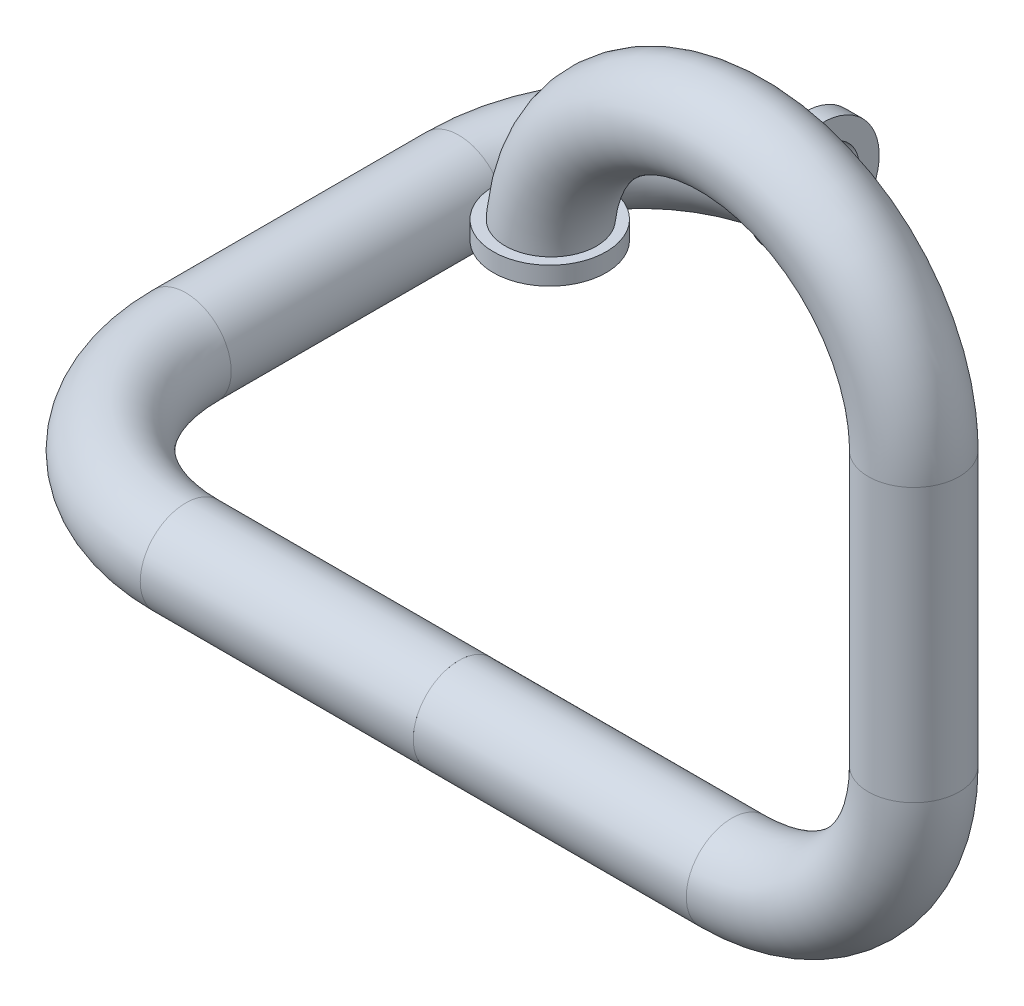
ISO-10303-21;
HEADER;
FILE_DESCRIPTION(('STEP AP214'),'2;1');
FILE_NAME('part.step','',(''),(''),'','','');
FILE_SCHEMA(('AUTOMOTIVE_DESIGN { 1 0 10303 214 1 1 1 1 }'));
ENDSEC;
DATA;
#1=APPLICATION_CONTEXT('core data for automotive mechanical design processes');
#2=APPLICATION_PROTOCOL_DEFINITION('international standard','automotive_design',2000,#1);
#3=PRODUCT_CONTEXT('',#1,'mechanical');
#4=PRODUCT('Part','Part','',(#3));
#5=PRODUCT_RELATED_PRODUCT_CATEGORY('part','',(#4));
#6=PRODUCT_DEFINITION_FORMATION('','',#4);
#7=PRODUCT_DEFINITION_CONTEXT('part definition',#1,'design');
#8=PRODUCT_DEFINITION('design','',#6,#7);
#9=PRODUCT_DEFINITION_SHAPE('','',#8);
#10=(LENGTH_UNIT() NAMED_UNIT(*) SI_UNIT(.MILLI.,.METRE.));
#11=(NAMED_UNIT(*) PLANE_ANGLE_UNIT() SI_UNIT($,.RADIAN.));
#12=(NAMED_UNIT(*) SI_UNIT($,.STERADIAN.) SOLID_ANGLE_UNIT());
#13=UNCERTAINTY_MEASURE_WITH_UNIT(LENGTH_MEASURE(1.E-05),#10,'distance_accuracy_value','');
#14=(GEOMETRIC_REPRESENTATION_CONTEXT(3) GLOBAL_UNCERTAINTY_ASSIGNED_CONTEXT((#13)) GLOBAL_UNIT_ASSIGNED_CONTEXT((#10,
#11,#12)) REPRESENTATION_CONTEXT('',''));
#15=CARTESIAN_POINT('',(0.,0.,0.));
#16=DIRECTION('',(0.,0.,1.));
#17=DIRECTION('',(1.,0.,0.));
#18=AXIS2_PLACEMENT_3D('',#15,#16,#17);
#19=CARTESIAN_POINT('',(-1.,-2.49999999999997,-2.5));
#20=DIRECTION('',(0.,-1.,0.));
#21=DIRECTION('',(-1.,0.,0.));
#22=AXIS2_PLACEMENT_3D('',#19,#20,#21);
#23=TOROIDAL_SURFACE('',#22,1.,0.25);
#24=CARTESIAN_POINT('',(-2.,-2.49999999999997,-2.5));
#25=DIRECTION('',(0.,0.,1.));
#26=DIRECTION('',(1.,0.,0.));
#27=AXIS2_PLACEMENT_3D('',#24,#25,#26);
#28=CIRCLE('',#27,0.25);
#29=CARTESIAN_POINT('',(-1.75,-2.49999999999997,-2.5));
#30=VERTEX_POINT('',#29);
#31=EDGE_CURVE('E69',#30,#30,#28,.T.);
#32=ORIENTED_EDGE('',*,*,#31,.F.);
#33=EDGE_LOOP('',(#32));
#34=FACE_BOUND('',#33,.T.);
#35=CARTESIAN_POINT('',(-1.1,-2.65623963793902,-3.29859890368239));
#36=CARTESIAN_POINT('',(-1.1,-2.66725207760954,-3.30748461825524));
#37=CARTESIAN_POINT('',(-1.1,-2.67751891621626,-3.31731154482602));
#38=CARTESIAN_POINT('',(-1.1,-2.69626373386053,-3.33855979360369));
#39=CARTESIAN_POINT('',(-1.1,-2.70473937428027,-3.34998316824432));
#40=CARTESIAN_POINT('',(-1.1,-2.71965059164286,-3.37408196910666));
#41=CARTESIAN_POINT('',(-1.1,-2.72608758280257,-3.386756519343));
#42=CARTESIAN_POINT('',(-1.1,-2.73674792220665,-3.41300023448786));
#43=CARTESIAN_POINT('',(-1.1,-2.74097185095739,-3.42656916374023));
#44=CARTESIAN_POINT('',(-1.1,-2.74710037643283,-3.45426609808908));
#45=CARTESIAN_POINT('',(-1.1,-2.74899764423923,-3.46839572582249));
#46=CARTESIAN_POINT('',(-1.1,-2.7503929044324,-3.49677370794496));
#47=CARTESIAN_POINT('',(-1.1,-2.74989078403278,-3.51102206788375));
#48=CARTESIAN_POINT('',(-1.1,-2.74649821555128,-3.53922913334701));
#49=CARTESIAN_POINT('',(-1.1,-2.7436082057798,-3.5531878915475));
#50=CARTESIAN_POINT('',(-1.1,-2.73551838704396,-3.58041932555233));
#51=CARTESIAN_POINT('',(-1.1,-2.73031861462664,-3.59369201220857));
#52=CARTESIAN_POINT('',(-1.1,-2.71777309713946,-3.61913001861259));
#53=CARTESIAN_POINT('',(-1.1,-2.71043405726885,-3.63129864492456));
#54=CARTESIAN_POINT('',(-1.1,-2.69380938875734,-3.65422440361082));
#55=CARTESIAN_POINT('',(-1.1,-2.68452380420333,-3.66498156794405));
#56=CARTESIAN_POINT('',(-1.1,-2.66430995715404,-3.68473296660521));
#57=CARTESIAN_POINT('',(-1.1,-2.65338847528619,-3.69373414042714));
#58=CARTESIAN_POINT('',(-1.1,-2.63018485864796,-3.7097674288013));
#59=CARTESIAN_POINT('',(-1.1,-2.61790274918155,-3.7167995799634));
#60=CARTESIAN_POINT('',(-1.1,-2.59237323038552,-3.72866989147601));
#61=CARTESIAN_POINT('',(-1.1,-2.57912937079562,-3.73351568693935));
#62=CARTESIAN_POINT('',(-1.1,-2.55201508745365,-3.74090948117469));
#63=CARTESIAN_POINT('',(-1.1,-2.53814467275927,-3.74345751315272));
#64=CARTESIAN_POINT('',(-1.1,-2.5102038849674,-3.74617903253143));
#65=CARTESIAN_POINT('',(-1.1,-2.49613402183291,-3.74635775803878));
#66=CARTESIAN_POINT('',(-1.1,-2.46816429077879,-3.7443490557881));
#67=CARTESIAN_POINT('',(-1.1,-2.4542644218515,-3.74216164206245));
#68=CARTESIAN_POINT('',(-1.1,-2.42703714682501,-3.73548566564956));
#69=CARTESIAN_POINT('',(-1.1,-2.41370942348579,-3.73099839651049));
#70=CARTESIAN_POINT('',(-1.1,-2.38799527759161,-3.71985250641525));
#71=CARTESIAN_POINT('',(-1.1,-2.37560885748421,-3.7131938798134));
#72=CARTESIAN_POINT('',(-1.1,-2.35211278170529,-3.69788731542389));
#73=CARTESIAN_POINT('',(-1.1,-2.34100461687592,-3.68923708938564));
#74=CARTESIAN_POINT('',(-1.1,-2.3203933598736,-3.67019911655825));
#75=CARTESIAN_POINT('',(-1.1,-2.3108902858315,-3.65981135014478));
#76=CARTESIAN_POINT('',(-1.1,-2.29373053982587,-3.63756371948689));
#77=CARTESIAN_POINT('',(-1.1,-2.28607894695728,-3.6256999380033));
#78=CARTESIAN_POINT('',(-1.1,-2.2728674582373,-3.60086000651179));
#79=CARTESIAN_POINT('',(-1.1,-2.26730760120466,-3.58788383586549));
#80=CARTESIAN_POINT('',(-1.1,-2.25841456798207,-3.56113487356717));
#81=CARTESIAN_POINT('',(-1.1,-2.25508993780622,-3.54735924079537));
#82=CARTESIAN_POINT('',(-1.1,-2.25079070072853,-3.51944604647422));
#83=CARTESIAN_POINT('',(-1.1,-2.24981614861393,-3.50530847649481));
#84=CARTESIAN_POINT('',(-1.1,-2.25024182801909,-3.4770136765723));
#85=CARTESIAN_POINT('',(-1.1,-2.25165137413854,-3.46285658644129));
#86=CARTESIAN_POINT('',(-1.1,-2.25682122574272,-3.43497822630541));
#87=CARTESIAN_POINT('',(-1.1,-2.2605815751941,-3.42125696445682));
#88=CARTESIAN_POINT('',(-1.1,-2.27035874608223,-3.39460613735038));
#89=CARTESIAN_POINT('',(-1.1,-2.27638090606419,-3.38167853001149));
#90=CARTESIAN_POINT('',(-1.1,-2.29051249490454,-3.35701911324203));
#91=CARTESIAN_POINT('',(-1.1,-2.29862193372864,-3.3452873095212));
#92=CARTESIAN_POINT('',(-1.1,-2.31669082732941,-3.32337073898221));
#93=CARTESIAN_POINT('',(-1.1,-2.32664803560638,-3.31318412058785));
#94=CARTESIAN_POINT('',(-1.1,-2.34814005090378,-3.29463870405255));
#95=CARTESIAN_POINT('',(-1.1,-2.35967481605871,-3.28627985742117));
#96=CARTESIAN_POINT('',(-1.1,-2.38392513538251,-3.27168127958962));
#97=CARTESIAN_POINT('',(-1.1,-2.39663352689323,-3.26542965254311));
#98=CARTESIAN_POINT('',(-1.1,-2.42292480081764,-3.25516854334937));
#99=CARTESIAN_POINT('',(-1.1,-2.43650760332564,-3.25115885665188));
#100=CARTESIAN_POINT('',(-1.1,-2.46404545577347,-3.24552688282323));
#101=CARTESIAN_POINT('',(-1.1,-2.47799663724179,-3.24388566967865));
#102=CARTESIAN_POINT('',(-1.1,-2.50597955267885,-3.24298034692899));
#103=CARTESIAN_POINT('',(-1.1,-2.52001130360179,-3.24371675742366));
#104=CARTESIAN_POINT('',(-1.1,-2.54769244267739,-3.24753647692591));
#105=CARTESIAN_POINT('',(-1.1,-2.56134313820702,-3.25061036534622));
#106=CARTESIAN_POINT('',(-1.1,-2.58792473279217,-3.2589995811081));
#107=CARTESIAN_POINT('',(-1.1,-2.60085647623826,-3.26431221334144));
#108=CARTESIAN_POINT('',(-1.1,-2.62086769552547,-3.27456413039254));
#109=CARTESIAN_POINT('',(-1.1,-2.62828402648601,-3.2788601779382));
#110=CARTESIAN_POINT('',(-1.1,-2.64263780387059,-3.28818888620585));
#111=CARTESIAN_POINT('',(-1.1,-2.6495752514394,-3.29322154516689));
#112=CARTESIAN_POINT('',(-1.1,-2.65623963793902,-3.29859890368239));
#113=B_SPLINE_CURVE_WITH_KNOTS('',3,(#35,#36,#37,#38,#39,#40,#41,#42,#43,#44,#45,#46,#47,#48,
#49,#50,#51,#52,#53,#54,#55,#56,#57,#58,#59,#60,#61,#62,#63,#64,#65,#66,#67,#68,#69,#70,#71,#72,
#73,#74,#75,#76,#77,#78,#79,#80,#81,#82,#83,#84,#85,#86,#87,#88,#89,#90,#91,#92,#93,#94,#95,#96,
#97,#98,#99,#100,#101,#102,#103,#104,#105,#106,#107,#108,#109,#110,#111,#112),.UNSPECIFIED.,.T.,
.F.,(4,2,2,2,2,2,2,2,2,2,2,2,2,2,2,2,2,2,2,2,2,2,2,2,2,2,2,2,2,2,2,2,2,2,2,2,2,2,4),(0.,
0.0424192772184807,0.084893600183786,0.127338393721264,0.169772048022751,0.21233902665477,
0.254908006223219,0.297469173753553,0.340029667868765,0.382458171419216,0.424885714119334,
0.467142031024321,0.509397562208716,0.551504365817852,0.593610560912518,0.635623651286504,
0.677636492503144,0.719625729586843,0.76161507584624,0.803652908716628,0.845691216407669,
0.88784357092604,0.929996707675384,0.97231010702195,1.01462449280908,1.05710458176961,
1.09958546525149,1.14216725288102,1.18474924382094,1.22727979920904,1.26980922613231,
1.3120943759003,1.35437566702383,1.39631718923709,1.43826788668425,1.48005040315259,
1.52178276285504,1.54745365347394,1.57312448272488),.UNSPECIFIED.);
#114=CARTESIAN_POINT('',(-1.1,-2.65623963793902,-3.29859890368239));
#115=VERTEX_POINT('',#114);
#116=EDGE_CURVE('E12',#115,#115,#113,.T.);
#117=ORIENTED_EDGE('',*,*,#116,.F.);
#118=EDGE_LOOP('',(#117));
#119=FACE_BOUND('',#118,.T.);
#120=ADVANCED_FACE('F39',(#34,#119),#23,.T.);
#121=CARTESIAN_POINT('',(0.5,-2.49999999999997,-2.5));
#122=DIRECTION('',(1.,0.,0.));
#123=DIRECTION('',(0.,-1.,0.));
#124=AXIS2_PLACEMENT_3D('',#121,#122,#123);
#125=PLANE('',#124);
#126=CARTESIAN_POINT('',(0.5,-2.5,0.));
#127=DIRECTION('',(1.,0.,0.));
#128=DIRECTION('',(0.,-1.,0.));
#129=AXIS2_PLACEMENT_3D('',#126,#127,#128);
#130=CIRCLE('',#129,0.2);
#131=CARTESIAN_POINT('',(0.5,-2.7,0.));
#132=VERTEX_POINT('',#131);
#133=EDGE_CURVE('E59',#132,#132,#130,.F.);
#134=ORIENTED_EDGE('',*,*,#133,.T.);
#135=EDGE_LOOP('',(#134));
#136=FACE_BOUND('',#135,.T.);
#137=CARTESIAN_POINT('',(0.5,-2.5,0.));
#138=DIRECTION('',(1.,0.,0.));
#139=DIRECTION('',(0.,-1.,0.));
#140=AXIS2_PLACEMENT_3D('',#137,#138,#139);
#141=CIRCLE('',#140,0.25);
#142=CARTESIAN_POINT('',(0.5,-2.75,0.));
#143=VERTEX_POINT('',#142);
#144=EDGE_CURVE('E54',#143,#143,#141,.F.);
#145=ORIENTED_EDGE('',*,*,#144,.F.);
#146=EDGE_LOOP('',(#145));
#147=FACE_BOUND('',#146,.T.);
#148=ADVANCED_FACE('F116',(#136,#147),#125,.T.);
#149=CARTESIAN_POINT('',(-1.,-2.5,0.));
#150=DIRECTION('',(1.,0.,0.));
#151=DIRECTION('',(0.,0.,-1.));
#152=AXIS2_PLACEMENT_3D('',#149,#150,#151);
#153=CYLINDRICAL_SURFACE('',#152,0.25);
#154=CARTESIAN_POINT('',(-1.,-2.5,0.));
#155=DIRECTION('',(1.,0.,0.));
#156=DIRECTION('',(0.,0.,-1.));
#157=AXIS2_PLACEMENT_3D('',#154,#155,#156);
#158=CIRCLE('',#157,0.25);
#159=CARTESIAN_POINT('',(-1.,-2.5,0.25));
#160=VERTEX_POINT('',#159);
#161=EDGE_CURVE('E78',#160,#160,#158,.T.);
#162=ORIENTED_EDGE('',*,*,#161,.T.);
#163=EDGE_LOOP('',(#162));
#164=FACE_BOUND('',#163,.T.);
#165=ORIENTED_EDGE('',*,*,#144,.T.);
#166=EDGE_LOOP('',(#165));
#167=FACE_BOUND('',#166,.T.);
#168=ADVANCED_FACE('F121',(#164,#167),#153,.T.);
#169=CARTESIAN_POINT('',(-1.,-2.5,0.));
#170=DIRECTION('',(1.,0.,0.));
#171=DIRECTION('',(0.,0.,-1.));
#172=AXIS2_PLACEMENT_3D('',#169,#170,#171);
#173=CYLINDRICAL_SURFACE('',#172,0.2);
#174=CARTESIAN_POINT('',(-1.,-2.5,0.));
#175=DIRECTION('',(1.,0.,0.));
#176=DIRECTION('',(0.,1.,0.));
#177=AXIS2_PLACEMENT_3D('',#174,#175,#176);
#178=CIRCLE('',#177,0.2);
#179=CARTESIAN_POINT('',(-1.,-2.5,0.2));
#180=VERTEX_POINT('',#179);
#181=EDGE_CURVE('E50',#180,#180,#178,.T.);
#182=ORIENTED_EDGE('',*,*,#181,.F.);
#183=EDGE_LOOP('',(#182));
#184=FACE_BOUND('',#183,.T.);
#185=ORIENTED_EDGE('',*,*,#133,.F.);
#186=EDGE_LOOP('',(#185));
#187=FACE_BOUND('',#186,.T.);
#188=ADVANCED_FACE('F41',(#184,#187),#173,.F.);
#189=CARTESIAN_POINT('',(-1.,-2.49999999999997,-2.5));
#190=DIRECTION('',(1.,0.,0.));
#191=DIRECTION('',(0.,-1.,0.));
#192=AXIS2_PLACEMENT_3D('',#189,#190,#191);
#193=PLANE('',#192);
#194=CARTESIAN_POINT('',(-1.,-2.49999999999996,-3.5));
#195=DIRECTION('',(1.,0.,0.));
#196=DIRECTION('',(0.,-1.,0.));
#197=AXIS2_PLACEMENT_3D('',#194,#195,#196);
#198=CIRCLE('',#197,0.31);
#199=CARTESIAN_POINT('',(-1.,-2.80999999999996,-3.5));
#200=VERTEX_POINT('',#199);
#201=EDGE_CURVE('E86',#200,#200,#198,.T.);
#202=ORIENTED_EDGE('',*,*,#201,.T.);
#203=EDGE_LOOP('',(#202));
#204=FACE_BOUND('',#203,.T.);
#205=CARTESIAN_POINT('',(-1.,-2.49999999999996,-3.5));
#206=DIRECTION('',(1.,0.,0.));
#207=DIRECTION('',(0.,-1.,0.));
#208=AXIS2_PLACEMENT_3D('',#205,#206,#207);
#209=CIRCLE('',#208,0.2);
#210=CARTESIAN_POINT('',(-1.,-2.49999999999996,-3.7));
#211=VERTEX_POINT('',#210);
#212=EDGE_CURVE('E62',#211,#211,#209,.T.);
#213=ORIENTED_EDGE('',*,*,#212,.F.);
#214=EDGE_LOOP('',(#213));
#215=FACE_BOUND('',#214,.T.);
#216=ADVANCED_FACE('F110',(#204,#215),#193,.T.);
#217=CARTESIAN_POINT('',(-2.,-2.49999999999997,-2.5));
#218=DIRECTION('',(0.,0.,1.));
#219=DIRECTION('',(1.,0.,0.));
#220=AXIS2_PLACEMENT_3D('',#217,#218,#219);
#221=CYLINDRICAL_SURFACE('',#220,0.25);
#222=ORIENTED_EDGE('',*,*,#31,.T.);
#223=EDGE_LOOP('',(#222));
#224=FACE_BOUND('',#223,.T.);
#225=CARTESIAN_POINT('',(-2.,-2.49999999999999,-1.));
#226=DIRECTION('',(0.,0.,-1.));
#227=DIRECTION('',(-1.,0.,0.));
#228=AXIS2_PLACEMENT_3D('',#225,#226,#227);
#229=CIRCLE('',#228,0.25);
#230=CARTESIAN_POINT('',(-2.25,-2.49999999999999,-1.));
#231=VERTEX_POINT('',#230);
#232=EDGE_CURVE('E65',#231,#231,#229,.F.);
#233=ORIENTED_EDGE('',*,*,#232,.F.);
#234=EDGE_LOOP('',(#233));
#235=FACE_BOUND('',#234,.T.);
#236=ADVANCED_FACE('F123',(#224,#235),#221,.T.);
#237=CARTESIAN_POINT('',(-1.,-2.49999999999999,-1.));
#238=DIRECTION('',(0.,1.,0.));
#239=DIRECTION('',(1.,0.,0.));
#240=AXIS2_PLACEMENT_3D('',#237,#238,#239);
#241=TOROIDAL_SURFACE('',#240,1.,0.25);
#242=CARTESIAN_POINT('',(-1.,-2.49999999999999,-1.));
#243=DIRECTION('',(0.,1.,0.));
#244=DIRECTION('',(1.,0.,0.));
#245=AXIS2_PLACEMENT_3D('',#242,#243,#244);
#246=CIRCLE('',#245,1.25);
#247=EDGE_CURVE('',#231,#160,#246,.T.);
#248=ORIENTED_EDGE('',*,*,#232,.T.);
#249=ORIENTED_EDGE('',*,*,#161,.F.);
#250=ORIENTED_EDGE('',*,*,#247,.T.);
#251=ORIENTED_EDGE('',*,*,#247,.F.);
#252=EDGE_LOOP('',(#248,#250,#249,#251));
#253=FACE_BOUND('',#252,.T.);
#254=ADVANCED_FACE('F111',(#253),#241,.T.);
#255=CARTESIAN_POINT('',(-2.,-2.49999999999997,-2.5));
#256=DIRECTION('',(0.,0.,1.));
#257=DIRECTION('',(1.,0.,0.));
#258=AXIS2_PLACEMENT_3D('',#255,#256,#257);
#259=CYLINDRICAL_SURFACE('',#258,0.2);
#260=CARTESIAN_POINT('',(-2.,-2.49999999999997,-2.5));
#261=DIRECTION('',(0.,0.,1.));
#262=DIRECTION('',(0.,1.,0.));
#263=AXIS2_PLACEMENT_3D('',#260,#261,#262);
#264=CIRCLE('',#263,0.2);
#265=CARTESIAN_POINT('',(-2.2,-2.49999999999997,-2.5));
#266=VERTEX_POINT('',#265);
#267=EDGE_CURVE('E84',#266,#266,#264,.T.);
#268=ORIENTED_EDGE('',*,*,#267,.F.);
#269=EDGE_LOOP('',(#268));
#270=FACE_BOUND('',#269,.T.);
#271=CARTESIAN_POINT('',(-2.,-2.49999999999999,-1.));
#272=DIRECTION('',(0.,0.,1.));
#273=DIRECTION('',(0.,1.,0.));
#274=AXIS2_PLACEMENT_3D('',#271,#272,#273);
#275=CIRCLE('',#274,0.2);
#276=CARTESIAN_POINT('',(-2.2,-2.49999999999999,-1.));
#277=VERTEX_POINT('',#276);
#278=EDGE_CURVE('E74',#277,#277,#275,.T.);
#279=ORIENTED_EDGE('',*,*,#278,.T.);
#280=EDGE_LOOP('',(#279));
#281=FACE_BOUND('',#280,.T.);
#282=ADVANCED_FACE('F98',(#270,#281),#259,.F.);
#283=CARTESIAN_POINT('',(-1.,-2.49999999999999,-1.));
#284=DIRECTION('',(0.,1.,0.));
#285=DIRECTION('',(1.,0.,0.));
#286=AXIS2_PLACEMENT_3D('',#283,#284,#285);
#287=TOROIDAL_SURFACE('',#286,1.,0.2);
#288=CARTESIAN_POINT('',(-1.,-2.49999999999999,-1.));
#289=DIRECTION('',(0.,1.,0.));
#290=DIRECTION('',(1.,0.,0.));
#291=AXIS2_PLACEMENT_3D('',#288,#289,#290);
#292=CIRCLE('',#291,1.2);
#293=EDGE_CURVE('',#277,#180,#292,.T.);
#294=ORIENTED_EDGE('',*,*,#278,.F.);
#295=ORIENTED_EDGE('',*,*,#181,.T.);
#296=ORIENTED_EDGE('',*,*,#293,.T.);
#297=ORIENTED_EDGE('',*,*,#293,.F.);
#298=EDGE_LOOP('',(#294,#296,#295,#297));
#299=FACE_BOUND('',#298,.T.);
#300=ADVANCED_FACE('F100',(#299),#287,.F.);
#301=CARTESIAN_POINT('',(-1.,-2.49999999999997,-2.5));
#302=DIRECTION('',(0.,-1.,0.));
#303=DIRECTION('',(-1.,0.,0.));
#304=AXIS2_PLACEMENT_3D('',#301,#302,#303);
#305=TOROIDAL_SURFACE('',#304,1.,0.2);
#306=CARTESIAN_POINT('',(-1.,-2.49999999999997,-2.5));
#307=DIRECTION('',(0.,-1.,0.));
#308=DIRECTION('',(-1.,0.,0.));
#309=AXIS2_PLACEMENT_3D('',#306,#307,#308);
#310=CIRCLE('',#309,1.2);
#311=EDGE_CURVE('',#266,#211,#310,.T.);
#312=ORIENTED_EDGE('',*,*,#267,.T.);
#313=ORIENTED_EDGE('',*,*,#212,.T.);
#314=ORIENTED_EDGE('',*,*,#311,.T.);
#315=ORIENTED_EDGE('',*,*,#311,.F.);
#316=EDGE_LOOP('',(#312,#314,#313,#315));
#317=FACE_BOUND('',#316,.T.);
#318=ADVANCED_FACE('F102',(#317),#305,.F.);
#319=CARTESIAN_POINT('',(-1.1,-2.49999999999996,-3.5));
#320=DIRECTION('',(1.,0.,0.));
#321=DIRECTION('',(0.,-1.,0.));
#322=AXIS2_PLACEMENT_3D('',#319,#320,#321);
#323=PLANE('',#322);
#324=CARTESIAN_POINT('',(-1.1,-2.49999999999996,-3.5));
#325=DIRECTION('',(1.,0.,0.));
#326=DIRECTION('',(0.,-1.,0.));
#327=AXIS2_PLACEMENT_3D('',#324,#325,#326);
#328=CIRCLE('',#327,0.31);
#329=CARTESIAN_POINT('',(-1.1,-2.80999999999996,-3.5));
#330=VERTEX_POINT('',#329);
#331=EDGE_CURVE('E80',#330,#330,#328,.T.);
#332=ORIENTED_EDGE('',*,*,#331,.F.);
#333=EDGE_LOOP('',(#332));
#334=FACE_BOUND('',#333,.T.);
#335=ORIENTED_EDGE('',*,*,#116,.T.);
#336=EDGE_LOOP('',(#335));
#337=FACE_BOUND('',#336,.T.);
#338=ADVANCED_FACE('F108',(#334,#337),#323,.F.);
#339=CARTESIAN_POINT('',(-1.1,-2.49999999999996,-3.5));
#340=DIRECTION('',(1.,0.,0.));
#341=DIRECTION('',(0.,-1.,0.));
#342=AXIS2_PLACEMENT_3D('',#339,#340,#341);
#343=CYLINDRICAL_SURFACE('',#342,0.31);
#344=ORIENTED_EDGE('',*,*,#331,.T.);
#345=EDGE_LOOP('',(#344));
#346=FACE_BOUND('',#345,.T.);
#347=ORIENTED_EDGE('',*,*,#201,.F.);
#348=EDGE_LOOP('',(#347));
#349=FACE_BOUND('',#348,.T.);
#350=ADVANCED_FACE('F208',(#346,#349),#343,.T.);
#351=CLOSED_SHELL('',(#120,#148,#168,#188,#216,#236,#254,#282,#300,#318,#338,#350));
#352=MANIFOLD_SOLID_BREP('B2',#351);
#353=CARTESIAN_POINT('',(0.5,0.,0.));
#354=DIRECTION('',(1.,0.,0.));
#355=DIRECTION('',(0.,0.,-1.));
#356=AXIS2_PLACEMENT_3D('',#353,#354,#355);
#357=PLANE('',#356);
#358=CARTESIAN_POINT('',(0.5,-2.5,0.));
#359=DIRECTION('',(1.,0.,0.));
#360=DIRECTION('',(0.,0.,-1.));
#361=AXIS2_PLACEMENT_3D('',#358,#359,#360);
#362=CIRCLE('',#361,0.25);
#363=CARTESIAN_POINT('',(0.5,-2.5,-0.25));
#364=VERTEX_POINT('',#363);
#365=EDGE_CURVE('E38',#364,#364,#362,.F.);
#366=ORIENTED_EDGE('',*,*,#365,.T.);
#367=EDGE_LOOP('',(#366));
#368=FACE_BOUND('',#367,.T.);
#369=CARTESIAN_POINT('',(0.5,-2.5,0.));
#370=DIRECTION('',(1.,0.,0.));
#371=DIRECTION('',(0.,0.,-1.));
#372=AXIS2_PLACEMENT_3D('',#369,#370,#371);
#373=CIRCLE('',#372,0.2);
#374=CARTESIAN_POINT('',(0.5,-2.5,-0.2));
#375=VERTEX_POINT('',#374);
#376=EDGE_CURVE('E239',#375,#375,#373,.F.);
#377=ORIENTED_EDGE('',*,*,#376,.F.);
#378=EDGE_LOOP('',(#377));
#379=FACE_BOUND('',#378,.T.);
#380=ADVANCED_FACE('F233',(#368,#379),#357,.F.);
#381=CARTESIAN_POINT('',(-1.,-2.5,0.));
#382=DIRECTION('',(1.,0.,0.));
#383=DIRECTION('',(0.,1.,0.));
#384=AXIS2_PLACEMENT_3D('',#381,#382,#383);
#385=CYLINDRICAL_SURFACE('',#384,0.25);
#386=ORIENTED_EDGE('',*,*,#365,.F.);
#387=EDGE_LOOP('',(#386));
#388=FACE_BOUND('',#387,.T.);
#389=CARTESIAN_POINT('',(2.,-2.5,0.));
#390=DIRECTION('',(1.,0.,0.));
#391=DIRECTION('',(0.,1.,0.));
#392=AXIS2_PLACEMENT_3D('',#389,#390,#391);
#393=CIRCLE('',#392,0.25);
#394=CARTESIAN_POINT('',(2.,-2.75,0.));
#395=VERTEX_POINT('',#394);
#396=EDGE_CURVE('E243',#395,#395,#393,.T.);
#397=ORIENTED_EDGE('',*,*,#396,.F.);
#398=EDGE_LOOP('',(#397));
#399=FACE_BOUND('',#398,.T.);
#400=ADVANCED_FACE('F276',(#388,#399),#385,.T.);
#401=CARTESIAN_POINT('',(1.,0.,0.));
#402=DIRECTION('',(0.,1.,0.));
#403=DIRECTION('',(0.,0.,1.));
#404=AXIS2_PLACEMENT_3D('',#401,#402,#403);
#405=PLANE('',#404);
#406=CARTESIAN_POINT('',(1.,0.,0.));
#407=DIRECTION('',(0.,-1.,0.));
#408=DIRECTION('',(0.,0.,1.));
#409=AXIS2_PLACEMENT_3D('',#406,#407,#408);
#410=CIRCLE('',#409,0.2);
#411=CARTESIAN_POINT('',(0.800000000000001,0.,0.));
#412=VERTEX_POINT('',#411);
#413=EDGE_CURVE('E257',#412,#412,#410,.T.);
#414=ORIENTED_EDGE('',*,*,#413,.F.);
#415=EDGE_LOOP('',(#414));
#416=FACE_BOUND('',#415,.T.);
#417=CARTESIAN_POINT('',(1.,0.,0.));
#418=DIRECTION('',(0.,-1.,0.));
#419=DIRECTION('',(0.,0.,1.));
#420=AXIS2_PLACEMENT_3D('',#417,#418,#419);
#421=CIRCLE('',#420,0.31);
#422=CARTESIAN_POINT('',(1.,0.,0.31));
#423=VERTEX_POINT('',#422);
#424=EDGE_CURVE('E320',#423,#423,#421,.T.);
#425=ORIENTED_EDGE('',*,*,#424,.T.);
#426=EDGE_LOOP('',(#425));
#427=FACE_BOUND('',#426,.T.);
#428=ADVANCED_FACE('F278',(#416,#427),#405,.F.);
#429=CARTESIAN_POINT('',(2.,0.,0.));
#430=DIRECTION('',(0.,0.,-1.));
#431=DIRECTION('',(1.,0.,0.));
#432=AXIS2_PLACEMENT_3D('',#429,#430,#431);
#433=TOROIDAL_SURFACE('',#432,1.,0.2);
#434=CARTESIAN_POINT('',(3.,0.,0.));
#435=DIRECTION('',(0.,1.,0.));
#436=DIRECTION('',(0.,0.,1.));
#437=AXIS2_PLACEMENT_3D('',#434,#435,#436);
#438=CIRCLE('',#437,0.2);
#439=CARTESIAN_POINT('',(3.2,0.,0.));
#440=VERTEX_POINT('',#439);
#441=EDGE_CURVE('E327',#440,#440,#438,.T.);
#442=CARTESIAN_POINT('',(2.,0.,0.));
#443=DIRECTION('',(0.,0.,-1.));
#444=DIRECTION('',(1.,0.,0.));
#445=AXIS2_PLACEMENT_3D('',#442,#443,#444);
#446=CIRCLE('',#445,1.2);
#447=EDGE_CURVE('',#412,#440,#446,.T.);
#448=ORIENTED_EDGE('',*,*,#413,.T.);
#449=ORIENTED_EDGE('',*,*,#441,.F.);
#450=ORIENTED_EDGE('',*,*,#447,.T.);
#451=ORIENTED_EDGE('',*,*,#447,.F.);
#452=EDGE_LOOP('',(#448,#450,#449,#451));
#453=FACE_BOUND('',#452,.T.);
#454=ADVANCED_FACE('F285',(#453),#433,.F.);
#455=CARTESIAN_POINT('',(3.,0.,0.));
#456=DIRECTION('',(0.,-1.,0.));
#457=DIRECTION('',(-1.,0.,0.));
#458=AXIS2_PLACEMENT_3D('',#455,#456,#457);
#459=CYLINDRICAL_SURFACE('',#458,0.2);
#460=ORIENTED_EDGE('',*,*,#441,.T.);
#461=EDGE_LOOP('',(#460));
#462=FACE_BOUND('',#461,.T.);
#463=CARTESIAN_POINT('',(3.,-1.5,0.));
#464=DIRECTION('',(0.,1.,0.));
#465=DIRECTION('',(0.,0.,1.));
#466=AXIS2_PLACEMENT_3D('',#463,#464,#465);
#467=CIRCLE('',#466,0.2);
#468=CARTESIAN_POINT('',(3.2,-1.5,0.));
#469=VERTEX_POINT('',#468);
#470=EDGE_CURVE('E330',#469,#469,#467,.T.);
#471=ORIENTED_EDGE('',*,*,#470,.F.);
#472=EDGE_LOOP('',(#471));
#473=FACE_BOUND('',#472,.T.);
#474=ADVANCED_FACE('F301',(#462,#473),#459,.F.);
#475=CARTESIAN_POINT('',(2.,-1.5,0.));
#476=DIRECTION('',(0.,0.,1.));
#477=DIRECTION('',(-1.,0.,0.));
#478=AXIS2_PLACEMENT_3D('',#475,#476,#477);
#479=TOROIDAL_SURFACE('',#478,1.,0.2);
#480=CARTESIAN_POINT('',(2.,-2.5,0.));
#481=DIRECTION('',(1.,0.,0.));
#482=DIRECTION('',(0.,0.,1.));
#483=AXIS2_PLACEMENT_3D('',#480,#481,#482);
#484=CIRCLE('',#483,0.2);
#485=CARTESIAN_POINT('',(2.,-2.7,0.));
#486=VERTEX_POINT('',#485);
#487=EDGE_CURVE('E333',#486,#486,#484,.T.);
#488=CARTESIAN_POINT('',(2.,-1.5,0.));
#489=DIRECTION('',(0.,0.,1.));
#490=DIRECTION('',(-1.,0.,0.));
#491=AXIS2_PLACEMENT_3D('',#488,#489,#490);
#492=CIRCLE('',#491,1.2);
#493=EDGE_CURVE('',#486,#469,#492,.T.);
#494=ORIENTED_EDGE('',*,*,#487,.F.);
#495=ORIENTED_EDGE('',*,*,#470,.T.);
#496=ORIENTED_EDGE('',*,*,#493,.T.);
#497=ORIENTED_EDGE('',*,*,#493,.F.);
#498=EDGE_LOOP('',(#494,#496,#495,#497));
#499=FACE_BOUND('',#498,.T.);
#500=ADVANCED_FACE('F275',(#499),#479,.F.);
#501=CARTESIAN_POINT('',(-1.,-2.5,0.));
#502=DIRECTION('',(1.,0.,0.));
#503=DIRECTION('',(0.,1.,0.));
#504=AXIS2_PLACEMENT_3D('',#501,#502,#503);
#505=CYLINDRICAL_SURFACE('',#504,0.2);
#506=ORIENTED_EDGE('',*,*,#376,.T.);
#507=EDGE_LOOP('',(#506));
#508=FACE_BOUND('',#507,.T.);
#509=ORIENTED_EDGE('',*,*,#487,.T.);
#510=EDGE_LOOP('',(#509));
#511=FACE_BOUND('',#510,.T.);
#512=ADVANCED_FACE('F272',(#508,#511),#505,.F.);
#513=CARTESIAN_POINT('',(1.,0.0999999999999996,0.));
#514=DIRECTION('',(0.,-1.,0.));
#515=DIRECTION('',(0.,0.,-1.));
#516=AXIS2_PLACEMENT_3D('',#513,#514,#515);
#517=CYLINDRICAL_SURFACE('',#516,0.31);
#518=CARTESIAN_POINT('',(1.,0.0999999999999996,0.));
#519=DIRECTION('',(0.,-1.,0.));
#520=DIRECTION('',(0.,0.,1.));
#521=AXIS2_PLACEMENT_3D('',#518,#519,#520);
#522=CIRCLE('',#521,0.31);
#523=CARTESIAN_POINT('',(1.,0.0999999999999996,0.31));
#524=VERTEX_POINT('',#523);
#525=EDGE_CURVE('E258',#524,#524,#522,.T.);
#526=ORIENTED_EDGE('',*,*,#525,.T.);
#527=EDGE_LOOP('',(#526));
#528=FACE_BOUND('',#527,.T.);
#529=ORIENTED_EDGE('',*,*,#424,.F.);
#530=EDGE_LOOP('',(#529));
#531=FACE_BOUND('',#530,.T.);
#532=ADVANCED_FACE('F274',(#528,#531),#517,.T.);
#533=CARTESIAN_POINT('',(1.,0.0999999999999996,0.));
#534=DIRECTION('',(0.,1.,0.));
#535=DIRECTION('',(0.,0.,1.));
#536=AXIS2_PLACEMENT_3D('',#533,#534,#535);
#537=PLANE('',#536);
#538=ORIENTED_EDGE('',*,*,#525,.F.);
#539=EDGE_LOOP('',(#538));
#540=FACE_BOUND('',#539,.T.);
#541=CARTESIAN_POINT('',(1.20140109631761,0.0999999999999994,-0.156239637939055));
#542=CARTESIAN_POINT('',(1.21019061571474,0.0999999999999994,-0.145344468335609));
#543=CARTESIAN_POINT('',(1.21807172210946,0.0999999999999994,-0.133703962300581));
#544=CARTESIAN_POINT('',(1.23177790310757,0.0999999999999994,-0.109257379143088));
#545=CARTESIAN_POINT('',(1.237600690406,0.0999999999999994,-0.096450025107835));
#546=CARTESIAN_POINT('',(1.24700765016561,0.0999999999999994,-0.0700386597896411));
#547=CARTESIAN_POINT('',(1.25059219436236,0.0999999999999994,-0.0564347812071185));
#548=CARTESIAN_POINT('',(1.25541318839992,0.0999999999999994,-0.0288206461573356));
#549=CARTESIAN_POINT('',(1.25665023046536,0.0999999999999994,-0.014810493090211));
#550=CARTESIAN_POINT('',(1.25674012956133,0.0999999999999994,0.0131538110387401));
#551=CARTESIAN_POINT('',(1.25560376128764,0.0999999999999994,0.0271079282969863));
#552=CARTESIAN_POINT('',(1.25100317267413,0.0999999999999994,0.0546272137432173));
#553=CARTESIAN_POINT('',(1.24753888231816,0.0999999999999994,0.0681923702197628));
#554=CARTESIAN_POINT('',(1.23838863374503,0.0999999999999994,0.0945453892648773));
#555=CARTESIAN_POINT('',(1.23270348712941,0.0999999999999994,0.107333533818285));
#556=CARTESIAN_POINT('',(1.21927977306228,0.0999999999999994,0.131782096781474));
#557=CARTESIAN_POINT('',(1.21154114762927,0.0999999999999994,0.143442483335476));
#558=CARTESIAN_POINT('',(1.19418083260693,0.0999999999999995,0.16538311643698));
#559=CARTESIAN_POINT('',(1.18454778916345,0.0999999999999995,0.175654378083549));
#560=CARTESIAN_POINT('',(1.16370586490868,0.0999999999999995,0.194449314988614));
#561=CARTESIAN_POINT('',(1.15249692087162,0.0999999999999995,0.202972920096664));
#562=CARTESIAN_POINT('',(1.12872743217782,0.0999999999999995,0.218098495866874));
#563=CARTESIAN_POINT('',(1.11615711045901,0.0999999999999995,0.224685104803622));
#564=CARTESIAN_POINT('',(1.09009255829582,0.0999999999999995,0.235665425768117));
#565=CARTESIAN_POINT('',(1.07659830142009,0.0999999999999995,0.240059075031189));
#566=CARTESIAN_POINT('',(1.0490037254833,0.0999999999999996,0.246545191192852));
#567=CARTESIAN_POINT('',(1.03490096979586,0.0999999999999996,0.248627297728038));
#568=CARTESIAN_POINT('',(1.00654593496887,0.0999999999999996,0.250394447161815));
#569=CARTESIAN_POINT('',(0.992293655189753,0.0999999999999996,0.250079479803207));
#570=CARTESIAN_POINT('',(0.964044783835867,0.0999999999999996,0.247058139402245));
#571=CARTESIAN_POINT('',(0.95004818958155,0.0999999999999996,0.244351791435899));
#572=CARTESIAN_POINT('',(0.922710586450209,0.0999999999999997,0.236620477359455));
#573=CARTESIAN_POINT('',(0.909369569109577,0.0999999999999997,0.23159554119143));
#574=CARTESIAN_POINT('',(0.883765586512359,0.0999999999999997,0.219384869006445));
#575=CARTESIAN_POINT('',(0.871499478830634,0.0999999999999997,0.212205722852414));
#576=CARTESIAN_POINT('',(0.848353160880975,0.0999999999999997,0.195882113872184));
#577=CARTESIAN_POINT('',(0.837472922002869,0.0999999999999997,0.186737691628039));
#578=CARTESIAN_POINT('',(0.817453819567474,0.0999999999999997,0.166782766405174));
#579=CARTESIAN_POINT('',(0.808308112284606,0.0999999999999997,0.155979129073377));
#580=CARTESIAN_POINT('',(0.791968057395513,0.0999999999999998,0.132985122648441));
#581=CARTESIAN_POINT('',(0.784773671079474,0.0999999999999998,0.120794781071202));
#582=CARTESIAN_POINT('',(0.772566712871766,0.0999999999999998,0.095420262938804));
#583=CARTESIAN_POINT('',(0.767546469379715,0.0999999999999998,0.0822397766594054));
#584=CARTESIAN_POINT('',(0.759795746832072,0.0999999999999998,0.0552219448415193));
#585=CARTESIAN_POINT('',(0.757065234762672,0.0999999999999998,0.0413846087766634));
#586=CARTESIAN_POINT('',(0.753976519279488,0.0999999999999998,0.013479573995303));
#587=CARTESIAN_POINT('',(0.753612942574423,0.0999999999999998,-0.000587530219673126));
#588=CARTESIAN_POINT('',(0.755254272349145,0.0999999999999998,-0.0285828177191339));
#589=CARTESIAN_POINT('',(0.757259164603744,0.0999999999999998,-0.0425110018374756));
#590=CARTESIAN_POINT('',(0.763577570254616,0.0999999999999998,-0.069824146498636));
#591=CARTESIAN_POINT('',(0.76788963229582,0.0999999999999998,-0.0832094428634802));
#592=CARTESIAN_POINT('',(0.778697386164953,0.0999999999999998,-0.109067212165587));
#593=CARTESIAN_POINT('',(0.785193080784411,0.0999999999999998,-0.121539683935882));
#594=CARTESIAN_POINT('',(0.800190008892191,0.0999999999999997,-0.145233133026621));
#595=CARTESIAN_POINT('',(0.808693418744189,0.0999999999999997,-0.156452732655624));
#596=CARTESIAN_POINT('',(0.827458597227383,0.0999999999999997,-0.177309784421281));
#597=CARTESIAN_POINT('',(0.837720388123736,0.0999999999999997,-0.18694721652102));
#598=CARTESIAN_POINT('',(0.859739463821489,0.0999999999999997,-0.20439458897411));
#599=CARTESIAN_POINT('',(0.871500649143087,0.0999999999999997,-0.212199606378334));
#600=CARTESIAN_POINT('',(0.896162545480009,0.0999999999999997,-0.225732886882564));
#601=CARTESIAN_POINT('',(0.909063279872268,0.0999999999999997,-0.231461107366438));
#602=CARTESIAN_POINT('',(0.935690177297002,0.0999999999999997,-0.240701650163389));
#603=CARTESIAN_POINT('',(0.949419285126398,0.0999999999999996,-0.244205486570355));
#604=CARTESIAN_POINT('',(0.977269513121592,0.0999999999999996,-0.248868281721869));
#605=CARTESIAN_POINT('',(0.991390626994743,0.0999999999999996,-0.250027278084741));
#606=CARTESIAN_POINT('',(1.01968231033146,0.0999999999999996,-0.249971637934856));
#607=CARTESIAN_POINT('',(1.03385286183813,0.0999999999999996,-0.248747884057992));
#608=CARTESIAN_POINT('',(1.06179290963795,0.0999999999999995,-0.243944388235435));
#609=CARTESIAN_POINT('',(1.07556229838005,0.0999999999999995,-0.240364020446176));
#610=CARTESIAN_POINT('',(1.10234573174545,0.0999999999999995,-0.230935097081438));
#611=CARTESIAN_POINT('',(1.1153574306868,0.0999999999999995,-0.225079887987269));
#612=CARTESIAN_POINT('',(1.14020018687569,0.0999999999999995,-0.211269182973001));
#613=CARTESIAN_POINT('',(1.15203262501892,0.0999999999999995,-0.203316184310893));
#614=CARTESIAN_POINT('',(1.17015055889538,0.0999999999999995,-0.188776882063845));
#615=CARTESIAN_POINT('',(1.17688861698793,0.0999999999999995,-0.182745072414765));
#616=CARTESIAN_POINT('',(1.18967760471602,0.0999999999999995,-0.169992202553551));
#617=CARTESIAN_POINT('',(1.19572853335573,0.0999999999999994,-0.163271141342544));
#618=CARTESIAN_POINT('',(1.20140109631761,0.0999999999999994,-0.156239637939055));
#619=B_SPLINE_CURVE_WITH_KNOTS('',3,(#541,#542,#543,#544,#545,#546,#547,#548,#549,#550,#551,
#552,#553,#554,#555,#556,#557,#558,#559,#560,#561,#562,#563,#564,#565,#566,#567,#568,#569,#570,
#571,#572,#573,#574,#575,#576,#577,#578,#579,#580,#581,#582,#583,#584,#585,#586,#587,#588,#589,
#590,#591,#592,#593,#594,#595,#596,#597,#598,#599,#600,#601,#602,#603,#604,#605,#606,#607,#608,
#609,#610,#611,#612,#613,#614,#615,#616,#617,#618),.UNSPECIFIED.,.T.,.F.,(4,2,2,2,2,2,2,2,2,2,2,
2,2,2,2,2,2,2,2,2,2,2,2,2,2,2,2,2,2,2,2,2,2,2,2,2,2,2,4),(0.,0.0419631052503928,
0.0839726964411998,0.125975308668973,0.167967323125762,0.209769118662524,0.251572171514233,
0.293359961905662,0.335148932332196,0.377196440897467,0.419245636907758,0.461619835954524,
0.503995247723258,0.54655982933734,0.589124593087474,0.631688910508933,0.6742526782734,
0.716687545691694,0.759121536933536,0.801384450217337,0.843646525038764,0.88575823574167,
0.927869339259047,0.969884810944665,1.01190003028372,1.05388885042508,1.09587772424463,
1.13791232469054,1.17994745743075,1.22209426111071,1.26424192959939,1.30654943795309,
1.34885626756105,1.39132529833847,1.43380561212635,1.47641112039157,1.51896613717817,
1.5460481653165,1.57313023270311),.UNSPECIFIED.);
#620=CARTESIAN_POINT('',(1.20140109631761,0.0999999999999994,-0.156239637939055));
#621=VERTEX_POINT('',#620);
#622=EDGE_CURVE('E250',#621,#621,#619,.T.);
#623=ORIENTED_EDGE('',*,*,#622,.T.);
#624=EDGE_LOOP('',(#623));
#625=FACE_BOUND('',#624,.T.);
#626=ADVANCED_FACE('F261',(#540,#625),#537,.T.);
#627=CARTESIAN_POINT('',(2.,0.,0.));
#628=DIRECTION('',(0.,0.,-1.));
#629=DIRECTION('',(1.,0.,0.));
#630=AXIS2_PLACEMENT_3D('',#627,#628,#629);
#631=TOROIDAL_SURFACE('',#630,1.,0.25);
#632=ORIENTED_EDGE('',*,*,#622,.F.);
#633=EDGE_LOOP('',(#632));
#634=FACE_BOUND('',#633,.T.);
#635=CARTESIAN_POINT('',(3.,0.,0.));
#636=DIRECTION('',(0.,1.,0.));
#637=DIRECTION('',(-1.,0.,0.));
#638=AXIS2_PLACEMENT_3D('',#635,#636,#637);
#639=CIRCLE('',#638,0.25);
#640=CARTESIAN_POINT('',(2.75,0.,0.));
#641=VERTEX_POINT('',#640);
#642=EDGE_CURVE('E259',#641,#641,#639,.T.);
#643=ORIENTED_EDGE('',*,*,#642,.T.);
#644=EDGE_LOOP('',(#643));
#645=FACE_BOUND('',#644,.T.);
#646=ADVANCED_FACE('F264',(#634,#645),#631,.T.);
#647=CARTESIAN_POINT('',(3.,0.,0.));
#648=DIRECTION('',(0.,-1.,0.));
#649=DIRECTION('',(-1.,0.,0.));
#650=AXIS2_PLACEMENT_3D('',#647,#648,#649);
#651=CYLINDRICAL_SURFACE('',#650,0.25);
#652=ORIENTED_EDGE('',*,*,#642,.F.);
#653=EDGE_LOOP('',(#652));
#654=FACE_BOUND('',#653,.T.);
#655=CARTESIAN_POINT('',(3.,-1.5,0.));
#656=DIRECTION('',(0.,-1.,0.));
#657=DIRECTION('',(1.,0.,0.));
#658=AXIS2_PLACEMENT_3D('',#655,#656,#657);
#659=CIRCLE('',#658,0.25);
#660=CARTESIAN_POINT('',(3.25,-1.5,0.));
#661=VERTEX_POINT('',#660);
#662=EDGE_CURVE('E247',#661,#661,#659,.F.);
#663=ORIENTED_EDGE('',*,*,#662,.T.);
#664=EDGE_LOOP('',(#663));
#665=FACE_BOUND('',#664,.T.);
#666=ADVANCED_FACE('F269',(#654,#665),#651,.T.);
#667=CARTESIAN_POINT('',(2.,-1.5,0.));
#668=DIRECTION('',(0.,0.,1.));
#669=DIRECTION('',(-1.,0.,0.));
#670=AXIS2_PLACEMENT_3D('',#667,#668,#669);
#671=TOROIDAL_SURFACE('',#670,1.,0.25);
#672=CARTESIAN_POINT('',(2.,-1.5,0.));
#673=DIRECTION('',(0.,0.,1.));
#674=DIRECTION('',(-1.,0.,0.));
#675=AXIS2_PLACEMENT_3D('',#672,#673,#674);
#676=CIRCLE('',#675,1.25);
#677=EDGE_CURVE('',#395,#661,#676,.T.);
#678=ORIENTED_EDGE('',*,*,#396,.T.);
#679=ORIENTED_EDGE('',*,*,#662,.F.);
#680=ORIENTED_EDGE('',*,*,#677,.T.);
#681=ORIENTED_EDGE('',*,*,#677,.F.);
#682=EDGE_LOOP('',(#678,#680,#679,#681));
#683=FACE_BOUND('',#682,.T.);
#684=ADVANCED_FACE('F280',(#683),#671,.T.);
#685=CLOSED_SHELL('',(#380,#400,#428,#454,#474,#500,#512,#532,#626,#646,#666,#684));
#686=MANIFOLD_SOLID_BREP('B7',#685);
#687=ADVANCED_BREP_SHAPE_REPRESENTATION('',(#18,#352,#686),#14);
#688=SHAPE_DEFINITION_REPRESENTATION(#9,#687);
ENDSEC;
END-ISO-10303-21;
